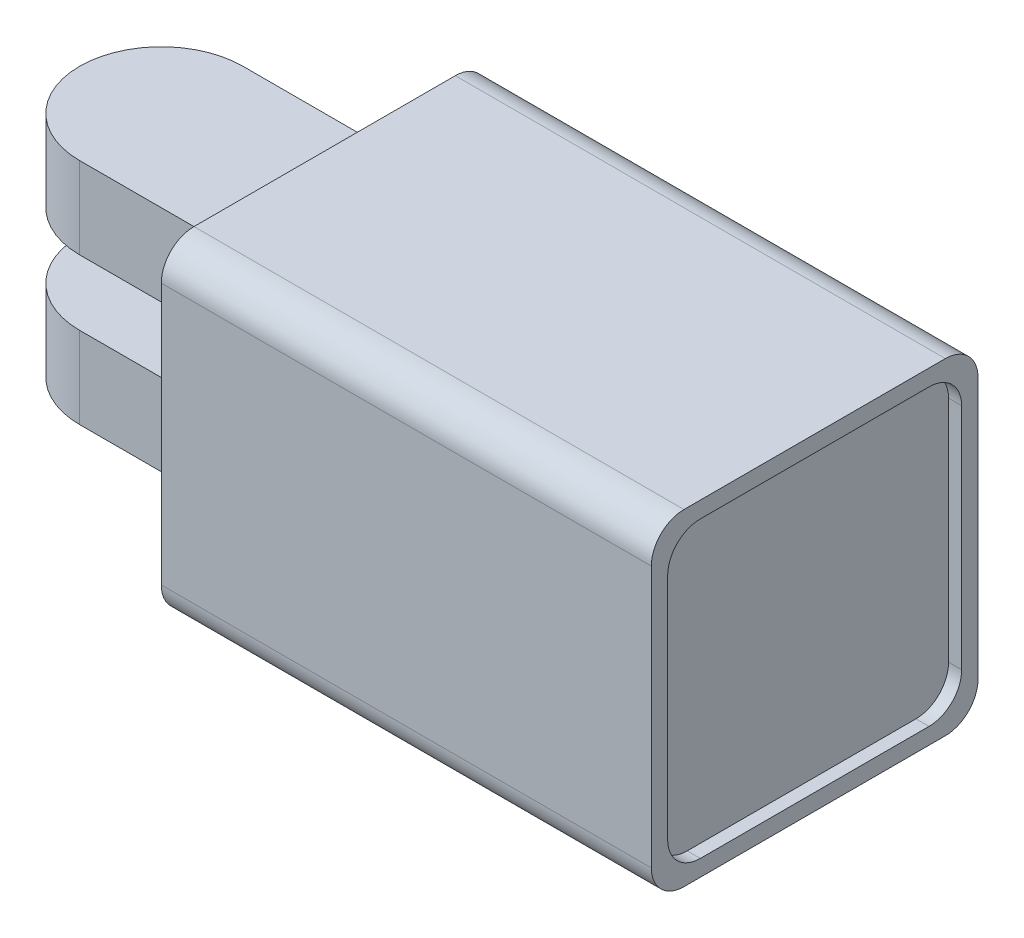
ISO-10303-21;
HEADER;
FILE_DESCRIPTION(('STEP AP214'),'2;1');
FILE_NAME('part.step','',(''),(''),'','','');
FILE_SCHEMA(('AUTOMOTIVE_DESIGN { 1 0 10303 214 1 1 1 1 }'));
ENDSEC;
DATA;
#1=APPLICATION_CONTEXT('core data for automotive mechanical design processes');
#2=APPLICATION_PROTOCOL_DEFINITION('international standard','automotive_design',2000,#1);
#3=PRODUCT_CONTEXT('',#1,'mechanical');
#4=PRODUCT('Part','Part','',(#3));
#5=PRODUCT_RELATED_PRODUCT_CATEGORY('part','',(#4));
#6=PRODUCT_DEFINITION_FORMATION('','',#4);
#7=PRODUCT_DEFINITION_CONTEXT('part definition',#1,'design');
#8=PRODUCT_DEFINITION('design','',#6,#7);
#9=PRODUCT_DEFINITION_SHAPE('','',#8);
#10=(LENGTH_UNIT() NAMED_UNIT(*) SI_UNIT(.MILLI.,.METRE.));
#11=(NAMED_UNIT(*) PLANE_ANGLE_UNIT() SI_UNIT($,.RADIAN.));
#12=(NAMED_UNIT(*) SI_UNIT($,.STERADIAN.) SOLID_ANGLE_UNIT());
#13=UNCERTAINTY_MEASURE_WITH_UNIT(LENGTH_MEASURE(1.E-05),#10,'distance_accuracy_value','');
#14=(GEOMETRIC_REPRESENTATION_CONTEXT(3) GLOBAL_UNCERTAINTY_ASSIGNED_CONTEXT((#13)) GLOBAL_UNIT_ASSIGNED_CONTEXT((#10,
#11,#12)) REPRESENTATION_CONTEXT('',''));
#15=CARTESIAN_POINT('',(0.,0.,0.));
#16=DIRECTION('',(0.,0.,1.));
#17=DIRECTION('',(1.,0.,0.));
#18=AXIS2_PLACEMENT_3D('',#15,#16,#17);
#19=CARTESIAN_POINT('',(0.,14.,0.));
#20=DIRECTION('',(0.,-1.,0.));
#21=DIRECTION('',(0.,0.,-1.));
#22=AXIS2_PLACEMENT_3D('',#19,#20,#21);
#23=CYLINDRICAL_SURFACE('',#22,5.);
#24=DIRECTION('',(0.,-1.,0.));
#25=VECTOR('',#24,1.);
#26=CARTESIAN_POINT('',(0.,14.,5.));
#27=LINE('',#26,#25);
#28=CARTESIAN_POINT('',(0.,5.,5.));
#29=VERTEX_POINT('',#28);
#30=CARTESIAN_POINT('',(0.,0.,5.));
#31=VERTEX_POINT('',#30);
#32=EDGE_CURVE('E473',#29,#31,#27,.T.);
#33=ORIENTED_EDGE('',*,*,#32,.F.);
#34=CARTESIAN_POINT('',(0.,5.,0.));
#35=DIRECTION('',(0.,-1.,0.));
#36=DIRECTION('',(0.,0.,-1.));
#37=AXIS2_PLACEMENT_3D('',#34,#35,#36);
#38=CIRCLE('',#37,5.);
#39=CARTESIAN_POINT('',(0.,5.,-5.));
#40=VERTEX_POINT('',#39);
#41=EDGE_CURVE('E296',#29,#40,#38,.T.);
#42=ORIENTED_EDGE('',*,*,#41,.T.);
#43=DIRECTION('',(0.,-1.,0.));
#44=VECTOR('',#43,1.);
#45=CARTESIAN_POINT('',(0.,14.,-5.));
#46=LINE('',#45,#44);
#47=CARTESIAN_POINT('',(0.,0.,-5.));
#48=VERTEX_POINT('',#47);
#49=EDGE_CURVE('E448',#40,#48,#46,.T.);
#50=ORIENTED_EDGE('',*,*,#49,.T.);
#51=CARTESIAN_POINT('',(0.,0.,0.));
#52=DIRECTION('',(0.,1.,0.));
#53=DIRECTION('',(0.,0.,1.));
#54=AXIS2_PLACEMENT_3D('',#51,#52,#53);
#55=CIRCLE('',#54,5.);
#56=EDGE_CURVE('E419',#48,#31,#55,.T.);
#57=ORIENTED_EDGE('',*,*,#56,.T.);
#58=EDGE_LOOP('',(#33,#42,#50,#57));
#59=FACE_BOUND('',#58,.T.);
#60=ADVANCED_FACE('F46',(#59),#23,.T.);
#61=CARTESIAN_POINT('',(37.,16.,-9.));
#62=DIRECTION('',(0.,0.,-1.));
#63=DIRECTION('',(0.,1.,0.));
#64=AXIS2_PLACEMENT_3D('',#61,#62,#63);
#65=PLANE('',#64);
#66=DIRECTION('',(0.,1.,0.));
#67=VECTOR('',#66,1.);
#68=CARTESIAN_POINT('',(39.2,14.,-9.));
#69=LINE('',#68,#67);
#70=CARTESIAN_POINT('',(39.2,0.,-9.));
#71=VERTEX_POINT('',#70);
#72=CARTESIAN_POINT('',(39.2,14.,-9.));
#73=VERTEX_POINT('',#72);
#74=EDGE_CURVE('E321',#71,#73,#69,.T.);
#75=ORIENTED_EDGE('',*,*,#74,.F.);
#76=DIRECTION('',(1.,0.,0.));
#77=VECTOR('',#76,1.);
#78=CARTESIAN_POINT('',(40.,0.,-9.));
#79=LINE('',#78,#77);
#80=CARTESIAN_POINT('',(40.,0.,-9.));
#81=VERTEX_POINT('',#80);
#82=EDGE_CURVE('E539',#71,#81,#79,.T.);
#83=ORIENTED_EDGE('',*,*,#82,.T.);
#84=DIRECTION('',(0.,1.,0.));
#85=VECTOR('',#84,1.);
#86=CARTESIAN_POINT('',(40.,16.,-9.));
#87=LINE('',#86,#85);
#88=CARTESIAN_POINT('',(40.,14.,-9.));
#89=VERTEX_POINT('',#88);
#90=EDGE_CURVE('E366',#81,#89,#87,.T.);
#91=ORIENTED_EDGE('',*,*,#90,.T.);
#92=DIRECTION('',(1.,0.,0.));
#93=VECTOR('',#92,1.);
#94=CARTESIAN_POINT('',(37.,14.,-9.));
#95=LINE('',#94,#93);
#96=EDGE_CURVE('E545',#89,#73,#95,.F.);
#97=ORIENTED_EDGE('',*,*,#96,.T.);
#98=EDGE_LOOP('',(#75,#83,#91,#97));
#99=FACE_BOUND('',#98,.T.);
#100=ADVANCED_FACE('F608',(#99),#65,.F.);
#101=CARTESIAN_POINT('',(37.,-2.00000000000001,9.));
#102=DIRECTION('',(0.,-1.,0.));
#103=DIRECTION('',(0.,0.,-1.));
#104=AXIS2_PLACEMENT_3D('',#101,#102,#103);
#105=PLANE('',#104);
#106=DIRECTION('',(0.,0.,-1.));
#107=VECTOR('',#106,1.);
#108=CARTESIAN_POINT('',(39.2,-2.00000000000001,7.));
#109=LINE('',#108,#107);
#110=CARTESIAN_POINT('',(39.2,-2.00000000000001,7.));
#111=VERTEX_POINT('',#110);
#112=CARTESIAN_POINT('',(39.2,-2.00000000000001,-7.));
#113=VERTEX_POINT('',#112);
#114=EDGE_CURVE('E313',#111,#113,#109,.T.);
#115=ORIENTED_EDGE('',*,*,#114,.F.);
#116=DIRECTION('',(1.,0.,0.));
#117=VECTOR('',#116,1.);
#118=CARTESIAN_POINT('',(40.,-2.00000000000001,7.));
#119=LINE('',#118,#117);
#120=CARTESIAN_POINT('',(40.,-2.00000000000001,7.));
#121=VERTEX_POINT('',#120);
#122=EDGE_CURVE('E561',#111,#121,#119,.T.);
#123=ORIENTED_EDGE('',*,*,#122,.T.);
#124=DIRECTION('',(0.,0.,-1.));
#125=VECTOR('',#124,1.);
#126=CARTESIAN_POINT('',(40.,-2.00000000000001,9.));
#127=LINE('',#126,#125);
#128=CARTESIAN_POINT('',(40.,-2.00000000000001,-7.));
#129=VERTEX_POINT('',#128);
#130=EDGE_CURVE('E375',#121,#129,#127,.T.);
#131=ORIENTED_EDGE('',*,*,#130,.T.);
#132=DIRECTION('',(1.,0.,0.));
#133=VECTOR('',#132,1.);
#134=CARTESIAN_POINT('',(37.,-2.00000000000001,-7.));
#135=LINE('',#134,#133);
#136=EDGE_CURVE('E567',#129,#113,#135,.F.);
#137=ORIENTED_EDGE('',*,*,#136,.T.);
#138=EDGE_LOOP('',(#115,#123,#131,#137));
#139=FACE_BOUND('',#138,.T.);
#140=ADVANCED_FACE('F616',(#139),#105,.F.);
#141=CARTESIAN_POINT('',(37.,16.,9.));
#142=DIRECTION('',(0.,0.,1.));
#143=DIRECTION('',(1.,0.,0.));
#144=AXIS2_PLACEMENT_3D('',#141,#142,#143);
#145=PLANE('',#144);
#146=DIRECTION('',(0.,-1.,0.));
#147=VECTOR('',#146,1.);
#148=CARTESIAN_POINT('',(39.2,14.,9.));
#149=LINE('',#148,#147);
#150=CARTESIAN_POINT('',(39.2,14.,9.));
#151=VERTEX_POINT('',#150);
#152=CARTESIAN_POINT('',(39.2,0.,9.));
#153=VERTEX_POINT('',#152);
#154=EDGE_CURVE('E304',#151,#153,#149,.T.);
#155=ORIENTED_EDGE('',*,*,#154,.F.);
#156=DIRECTION('',(1.,0.,0.));
#157=VECTOR('',#156,1.);
#158=CARTESIAN_POINT('',(40.,14.,9.));
#159=LINE('',#158,#157);
#160=CARTESIAN_POINT('',(40.,14.,9.));
#161=VERTEX_POINT('',#160);
#162=EDGE_CURVE('E571',#151,#161,#159,.T.);
#163=ORIENTED_EDGE('',*,*,#162,.T.);
#164=DIRECTION('',(0.,-1.,0.));
#165=VECTOR('',#164,1.);
#166=CARTESIAN_POINT('',(40.,16.,9.));
#167=LINE('',#166,#165);
#168=CARTESIAN_POINT('',(40.,0.,9.));
#169=VERTEX_POINT('',#168);
#170=EDGE_CURVE('E395',#161,#169,#167,.T.);
#171=ORIENTED_EDGE('',*,*,#170,.T.);
#172=DIRECTION('',(1.,0.,0.));
#173=VECTOR('',#172,1.);
#174=CARTESIAN_POINT('',(37.,0.,9.));
#175=LINE('',#174,#173);
#176=EDGE_CURVE('E577',#169,#153,#175,.F.);
#177=ORIENTED_EDGE('',*,*,#176,.T.);
#178=EDGE_LOOP('',(#155,#163,#171,#177));
#179=FACE_BOUND('',#178,.T.);
#180=ADVANCED_FACE('F722',(#179),#145,.F.);
#181=CARTESIAN_POINT('',(37.,16.,9.));
#182=DIRECTION('',(0.,1.,0.));
#183=DIRECTION('',(0.,0.,1.));
#184=AXIS2_PLACEMENT_3D('',#181,#182,#183);
#185=PLANE('',#184);
#186=DIRECTION('',(0.,0.,1.));
#187=VECTOR('',#186,1.);
#188=CARTESIAN_POINT('',(39.2,16.,7.));
#189=LINE('',#188,#187);
#190=CARTESIAN_POINT('',(39.2,16.,-7.));
#191=VERTEX_POINT('',#190);
#192=CARTESIAN_POINT('',(39.2,16.,7.));
#193=VERTEX_POINT('',#192);
#194=EDGE_CURVE('E70',#191,#193,#189,.T.);
#195=ORIENTED_EDGE('',*,*,#194,.F.);
#196=DIRECTION('',(1.,0.,0.));
#197=VECTOR('',#196,1.);
#198=CARTESIAN_POINT('',(40.,16.,-7.));
#199=LINE('',#198,#197);
#200=CARTESIAN_POINT('',(40.,16.,-7.));
#201=VERTEX_POINT('',#200);
#202=EDGE_CURVE('E534',#191,#201,#199,.T.);
#203=ORIENTED_EDGE('',*,*,#202,.T.);
#204=DIRECTION('',(0.,0.,1.));
#205=VECTOR('',#204,1.);
#206=CARTESIAN_POINT('',(40.,16.,9.));
#207=LINE('',#206,#205);
#208=CARTESIAN_POINT('',(40.,16.,7.));
#209=VERTEX_POINT('',#208);
#210=EDGE_CURVE('E391',#201,#209,#207,.T.);
#211=ORIENTED_EDGE('',*,*,#210,.T.);
#212=DIRECTION('',(1.,0.,0.));
#213=VECTOR('',#212,1.);
#214=CARTESIAN_POINT('',(37.,16.,7.));
#215=LINE('',#214,#213);
#216=EDGE_CURVE('E531',#209,#193,#215,.F.);
#217=ORIENTED_EDGE('',*,*,#216,.T.);
#218=EDGE_LOOP('',(#195,#203,#211,#217));
#219=FACE_BOUND('',#218,.T.);
#220=ADVANCED_FACE('F598',(#219),#185,.F.);
#221=CARTESIAN_POINT('',(37.,14.,-7.));
#222=DIRECTION('',(-1.,0.,0.));
#223=DIRECTION('',(0.,0.,1.));
#224=AXIS2_PLACEMENT_3D('',#221,#222,#223);
#225=CYLINDRICAL_SURFACE('',#224,2.);
#226=CARTESIAN_POINT('',(39.2,14.,-7.));
#227=DIRECTION('',(1.,0.,0.));
#228=DIRECTION('',(0.,0.,1.));
#229=AXIS2_PLACEMENT_3D('',#226,#227,#228);
#230=CIRCLE('',#229,2.);
#231=EDGE_CURVE('E325',#73,#191,#230,.T.);
#232=ORIENTED_EDGE('',*,*,#231,.F.);
#233=ORIENTED_EDGE('',*,*,#96,.F.);
#234=CARTESIAN_POINT('',(40.,14.,-7.));
#235=DIRECTION('',(-1.,0.,0.));
#236=DIRECTION('',(0.,0.,1.));
#237=AXIS2_PLACEMENT_3D('',#234,#235,#236);
#238=CIRCLE('',#237,2.);
#239=EDGE_CURVE('E581',#201,#89,#238,.T.);
#240=ORIENTED_EDGE('',*,*,#239,.F.);
#241=ORIENTED_EDGE('',*,*,#202,.F.);
#242=EDGE_LOOP('',(#232,#233,#240,#241));
#243=FACE_BOUND('',#242,.T.);
#244=ADVANCED_FACE('F606',(#243),#225,.F.);
#245=CARTESIAN_POINT('',(37.,0.,-7.));
#246=DIRECTION('',(-1.,0.,0.));
#247=DIRECTION('',(0.,0.,1.));
#248=AXIS2_PLACEMENT_3D('',#245,#246,#247);
#249=CYLINDRICAL_SURFACE('',#248,2.);
#250=CARTESIAN_POINT('',(39.2,0.,-7.));
#251=DIRECTION('',(1.,0.,0.));
#252=DIRECTION('',(0.,0.,1.));
#253=AXIS2_PLACEMENT_3D('',#250,#251,#252);
#254=CIRCLE('',#253,2.);
#255=EDGE_CURVE('E317',#113,#71,#254,.T.);
#256=ORIENTED_EDGE('',*,*,#255,.F.);
#257=ORIENTED_EDGE('',*,*,#136,.F.);
#258=CARTESIAN_POINT('',(40.,0.,-7.));
#259=DIRECTION('',(-1.,0.,0.));
#260=DIRECTION('',(0.,0.,1.));
#261=AXIS2_PLACEMENT_3D('',#258,#259,#260);
#262=CIRCLE('',#261,2.);
#263=EDGE_CURVE('E584',#81,#129,#262,.T.);
#264=ORIENTED_EDGE('',*,*,#263,.F.);
#265=ORIENTED_EDGE('',*,*,#82,.F.);
#266=EDGE_LOOP('',(#256,#257,#264,#265));
#267=FACE_BOUND('',#266,.T.);
#268=ADVANCED_FACE('F619',(#267),#249,.F.);
#269=CARTESIAN_POINT('',(37.,0.,7.));
#270=DIRECTION('',(-1.,0.,0.));
#271=DIRECTION('',(0.,0.,1.));
#272=AXIS2_PLACEMENT_3D('',#269,#270,#271);
#273=CYLINDRICAL_SURFACE('',#272,2.);
#274=CARTESIAN_POINT('',(39.2,0.,7.));
#275=DIRECTION('',(1.,0.,0.));
#276=DIRECTION('',(0.,0.,1.));
#277=AXIS2_PLACEMENT_3D('',#274,#275,#276);
#278=CIRCLE('',#277,2.);
#279=EDGE_CURVE('E309',#153,#111,#278,.T.);
#280=ORIENTED_EDGE('',*,*,#279,.F.);
#281=ORIENTED_EDGE('',*,*,#176,.F.);
#282=CARTESIAN_POINT('',(40.,0.,7.));
#283=DIRECTION('',(-1.,0.,0.));
#284=DIRECTION('',(0.,0.,1.));
#285=AXIS2_PLACEMENT_3D('',#282,#283,#284);
#286=CIRCLE('',#285,2.);
#287=EDGE_CURVE('E587',#121,#169,#286,.T.);
#288=ORIENTED_EDGE('',*,*,#287,.F.);
#289=ORIENTED_EDGE('',*,*,#122,.F.);
#290=EDGE_LOOP('',(#280,#281,#288,#289));
#291=FACE_BOUND('',#290,.T.);
#292=ADVANCED_FACE('F621',(#291),#273,.F.);
#293=CARTESIAN_POINT('',(37.,14.,7.));
#294=DIRECTION('',(-1.,0.,0.));
#295=DIRECTION('',(0.,0.,1.));
#296=AXIS2_PLACEMENT_3D('',#293,#294,#295);
#297=CYLINDRICAL_SURFACE('',#296,2.);
#298=CARTESIAN_POINT('',(39.2,14.,7.));
#299=DIRECTION('',(1.,0.,0.));
#300=DIRECTION('',(0.,0.,1.));
#301=AXIS2_PLACEMENT_3D('',#298,#299,#300);
#302=CIRCLE('',#301,2.);
#303=EDGE_CURVE('E300',#193,#151,#302,.T.);
#304=ORIENTED_EDGE('',*,*,#303,.F.);
#305=ORIENTED_EDGE('',*,*,#216,.F.);
#306=CARTESIAN_POINT('',(40.,14.,7.));
#307=DIRECTION('',(-1.,0.,0.));
#308=DIRECTION('',(0.,0.,1.));
#309=AXIS2_PLACEMENT_3D('',#306,#307,#308);
#310=CIRCLE('',#309,2.);
#311=EDGE_CURVE('E56',#161,#209,#310,.T.);
#312=ORIENTED_EDGE('',*,*,#311,.F.);
#313=ORIENTED_EDGE('',*,*,#162,.F.);
#314=EDGE_LOOP('',(#304,#305,#312,#313));
#315=FACE_BOUND('',#314,.T.);
#316=ADVANCED_FACE('F600',(#315),#297,.F.);
#317=CARTESIAN_POINT('',(0.,14.,-5.));
#318=VERTEX_POINT('',#317);
#319=CARTESIAN_POINT('',(0.,9.,-5.));
#320=VERTEX_POINT('',#319);
#321=EDGE_CURVE('E463',#318,#320,#46,.T.);
#322=ORIENTED_EDGE('',*,*,#321,.T.);
#323=CARTESIAN_POINT('',(0.,9.,0.));
#324=DIRECTION('',(0.,1.,0.));
#325=DIRECTION('',(0.,0.,1.));
#326=AXIS2_PLACEMENT_3D('',#323,#324,#325);
#327=CIRCLE('',#326,5.);
#328=CARTESIAN_POINT('',(0.,9.,5.));
#329=VERTEX_POINT('',#328);
#330=EDGE_CURVE('E63',#320,#329,#327,.T.);
#331=ORIENTED_EDGE('',*,*,#330,.T.);
#332=CARTESIAN_POINT('',(0.,14.,5.));
#333=VERTEX_POINT('',#332);
#334=EDGE_CURVE('E474',#333,#329,#27,.T.);
#335=ORIENTED_EDGE('',*,*,#334,.F.);
#336=CARTESIAN_POINT('',(0.,14.,0.));
#337=DIRECTION('',(0.,1.,0.));
#338=DIRECTION('',(0.,0.,1.));
#339=AXIS2_PLACEMENT_3D('',#336,#337,#338);
#340=CIRCLE('',#339,5.);
#341=EDGE_CURVE('E434',#318,#333,#340,.T.);
#342=ORIENTED_EDGE('',*,*,#341,.F.);
#343=EDGE_LOOP('',(#322,#331,#335,#342));
#344=FACE_BOUND('',#343,.T.);
#345=ADVANCED_FACE('F652',(#344),#23,.T.);
#346=CARTESIAN_POINT('',(10.,14.,5.));
#347=DIRECTION('',(0.,0.,-1.));
#348=DIRECTION('',(-1.,0.,0.));
#349=AXIS2_PLACEMENT_3D('',#346,#347,#348);
#350=PLANE('',#349);
#351=DIRECTION('',(0.,-1.,0.));
#352=VECTOR('',#351,1.);
#353=CARTESIAN_POINT('',(5.,14.,5.));
#354=LINE('',#353,#352);
#355=CARTESIAN_POINT('',(5.,9.,5.));
#356=VERTEX_POINT('',#355);
#357=CARTESIAN_POINT('',(5.,5.,5.));
#358=VERTEX_POINT('',#357);
#359=EDGE_CURVE('E265',#356,#358,#354,.T.);
#360=ORIENTED_EDGE('',*,*,#359,.T.);
#361=DIRECTION('',(-1.,0.,0.));
#362=VECTOR('',#361,1.);
#363=CARTESIAN_POINT('',(10.,5.,5.));
#364=LINE('',#363,#362);
#365=EDGE_CURVE('E292',#358,#29,#364,.T.);
#366=ORIENTED_EDGE('',*,*,#365,.T.);
#367=ORIENTED_EDGE('',*,*,#32,.T.);
#368=DIRECTION('',(1.,0.,0.));
#369=VECTOR('',#368,1.);
#370=CARTESIAN_POINT('',(10.,0.,5.));
#371=LINE('',#370,#369);
#372=CARTESIAN_POINT('',(10.,0.,5.));
#373=VERTEX_POINT('',#372);
#374=EDGE_CURVE('E452',#31,#373,#371,.T.);
#375=ORIENTED_EDGE('',*,*,#374,.T.);
#376=DIRECTION('',(0.,-1.,0.));
#377=VECTOR('',#376,1.);
#378=CARTESIAN_POINT('',(10.,14.,5.));
#379=LINE('',#378,#377);
#380=CARTESIAN_POINT('',(10.,14.,5.));
#381=VERTEX_POINT('',#380);
#382=EDGE_CURVE('E469',#381,#373,#379,.T.);
#383=ORIENTED_EDGE('',*,*,#382,.F.);
#384=DIRECTION('',(1.,0.,0.));
#385=VECTOR('',#384,1.);
#386=CARTESIAN_POINT('',(10.,14.,5.));
#387=LINE('',#386,#385);
#388=EDGE_CURVE('E438',#333,#381,#387,.T.);
#389=ORIENTED_EDGE('',*,*,#388,.F.);
#390=ORIENTED_EDGE('',*,*,#334,.T.);
#391=DIRECTION('',(1.,0.,0.));
#392=VECTOR('',#391,1.);
#393=CARTESIAN_POINT('',(10.,9.,5.));
#394=LINE('',#393,#392);
#395=EDGE_CURVE('E284',#329,#356,#394,.T.);
#396=ORIENTED_EDGE('',*,*,#395,.T.);
#397=EDGE_LOOP('',(#360,#366,#367,#375,#383,#389,#390,#396));
#398=FACE_BOUND('',#397,.T.);
#399=ADVANCED_FACE('F642',(#398),#350,.F.);
#400=CARTESIAN_POINT('',(0.,14.,-5.));
#401=DIRECTION('',(0.,0.,1.));
#402=DIRECTION('',(1.,0.,0.));
#403=AXIS2_PLACEMENT_3D('',#400,#401,#402);
#404=PLANE('',#403);
#405=ORIENTED_EDGE('',*,*,#49,.F.);
#406=DIRECTION('',(-1.,0.,0.));
#407=VECTOR('',#406,1.);
#408=CARTESIAN_POINT('',(5.,5.,-5.));
#409=LINE('',#408,#407);
#410=CARTESIAN_POINT('',(5.,5.,-5.));
#411=VERTEX_POINT('',#410);
#412=EDGE_CURVE('E269',#411,#40,#409,.T.);
#413=ORIENTED_EDGE('',*,*,#412,.F.);
#414=DIRECTION('',(0.,-1.,0.));
#415=VECTOR('',#414,1.);
#416=CARTESIAN_POINT('',(5.,9.,-5.));
#417=LINE('',#416,#415);
#418=CARTESIAN_POINT('',(5.,9.,-5.));
#419=VERTEX_POINT('',#418);
#420=EDGE_CURVE('E262',#419,#411,#417,.T.);
#421=ORIENTED_EDGE('',*,*,#420,.F.);
#422=DIRECTION('',(-1.,0.,0.));
#423=VECTOR('',#422,1.);
#424=CARTESIAN_POINT('',(0.,9.,-5.));
#425=LINE('',#424,#423);
#426=EDGE_CURVE('E11',#419,#320,#425,.T.);
#427=ORIENTED_EDGE('',*,*,#426,.T.);
#428=ORIENTED_EDGE('',*,*,#321,.F.);
#429=DIRECTION('',(-1.,0.,0.));
#430=VECTOR('',#429,1.);
#431=CARTESIAN_POINT('',(0.,14.,-5.));
#432=LINE('',#431,#430);
#433=CARTESIAN_POINT('',(10.,14.,-5.));
#434=VERTEX_POINT('',#433);
#435=EDGE_CURVE('E445',#434,#318,#432,.T.);
#436=ORIENTED_EDGE('',*,*,#435,.F.);
#437=DIRECTION('',(0.,-1.,0.));
#438=VECTOR('',#437,1.);
#439=CARTESIAN_POINT('',(10.,14.,-5.));
#440=LINE('',#439,#438);
#441=CARTESIAN_POINT('',(10.,0.,-5.));
#442=VERTEX_POINT('',#441);
#443=EDGE_CURVE('E466',#434,#442,#440,.T.);
#444=ORIENTED_EDGE('',*,*,#443,.T.);
#445=DIRECTION('',(-1.,0.,0.));
#446=VECTOR('',#445,1.);
#447=CARTESIAN_POINT('',(0.,0.,-5.));
#448=LINE('',#447,#446);
#449=EDGE_CURVE('E439',#442,#48,#448,.T.);
#450=ORIENTED_EDGE('',*,*,#449,.T.);
#451=EDGE_LOOP('',(#405,#413,#421,#427,#428,#436,#444,#450));
#452=FACE_BOUND('',#451,.T.);
#453=ADVANCED_FACE('F276',(#452),#404,.F.);
#454=CARTESIAN_POINT('',(0.,14.,0.));
#455=DIRECTION('',(0.,1.,0.));
#456=DIRECTION('',(0.,0.,1.));
#457=AXIS2_PLACEMENT_3D('',#454,#455,#456);
#458=PLANE('',#457);
#459=ORIENTED_EDGE('',*,*,#341,.T.);
#460=ORIENTED_EDGE('',*,*,#388,.T.);
#461=DIRECTION('',(0.,0.,-1.));
#462=VECTOR('',#461,1.);
#463=CARTESIAN_POINT('',(10.,14.,-5.));
#464=LINE('',#463,#462);
#465=EDGE_CURVE('E442',#381,#434,#464,.T.);
#466=ORIENTED_EDGE('',*,*,#465,.T.);
#467=ORIENTED_EDGE('',*,*,#435,.T.);
#468=EDGE_LOOP('',(#459,#460,#466,#467));
#469=FACE_BOUND('',#468,.T.);
#470=ADVANCED_FACE('F648',(#469),#458,.T.);
#471=CARTESIAN_POINT('',(0.,0.,0.));
#472=DIRECTION('',(0.,1.,0.));
#473=DIRECTION('',(0.,0.,1.));
#474=AXIS2_PLACEMENT_3D('',#471,#472,#473);
#475=PLANE('',#474);
#476=ORIENTED_EDGE('',*,*,#56,.F.);
#477=ORIENTED_EDGE('',*,*,#449,.F.);
#478=DIRECTION('',(0.,0.,-1.));
#479=VECTOR('',#478,1.);
#480=CARTESIAN_POINT('',(10.,0.,-5.));
#481=LINE('',#480,#479);
#482=EDGE_CURVE('E456',#373,#442,#481,.T.);
#483=ORIENTED_EDGE('',*,*,#482,.F.);
#484=ORIENTED_EDGE('',*,*,#374,.F.);
#485=EDGE_LOOP('',(#476,#477,#483,#484));
#486=FACE_BOUND('',#485,.T.);
#487=ADVANCED_FACE('F639',(#486),#475,.F.);
#488=CARTESIAN_POINT('',(40.,-3.,-10.));
#489=DIRECTION('',(0.,0.,1.));
#490=DIRECTION('',(1.,0.,0.));
#491=AXIS2_PLACEMENT_3D('',#488,#489,#490);
#492=PLANE('',#491);
#493=DIRECTION('',(0.,1.,0.));
#494=VECTOR('',#493,1.);
#495=CARTESIAN_POINT('',(10.,-3.,-10.));
#496=LINE('',#495,#494);
#497=CARTESIAN_POINT('',(10.,-1.,-10.));
#498=VERTEX_POINT('',#497);
#499=CARTESIAN_POINT('',(10.,15.,-10.));
#500=VERTEX_POINT('',#499);
#501=EDGE_CURVE('E387',#498,#500,#496,.T.);
#502=ORIENTED_EDGE('',*,*,#501,.T.);
#503=DIRECTION('',(-1.,0.,0.));
#504=VECTOR('',#503,1.);
#505=CARTESIAN_POINT('',(40.,15.,-10.));
#506=LINE('',#505,#504);
#507=CARTESIAN_POINT('',(40.,15.,-10.));
#508=VERTEX_POINT('',#507);
#509=EDGE_CURVE('E501',#500,#508,#506,.F.);
#510=ORIENTED_EDGE('',*,*,#509,.T.);
#511=DIRECTION('',(0.,1.,0.));
#512=VECTOR('',#511,1.);
#513=CARTESIAN_POINT('',(40.,-3.,-10.));
#514=LINE('',#513,#512);
#515=CARTESIAN_POINT('',(40.,-1.,-10.));
#516=VERTEX_POINT('',#515);
#517=EDGE_CURVE('E402',#516,#508,#514,.T.);
#518=ORIENTED_EDGE('',*,*,#517,.F.);
#519=DIRECTION('',(-1.,0.,0.));
#520=VECTOR('',#519,1.);
#521=CARTESIAN_POINT('',(40.,-1.,-10.));
#522=LINE('',#521,#520);
#523=EDGE_CURVE('E497',#516,#498,#522,.T.);
#524=ORIENTED_EDGE('',*,*,#523,.T.);
#525=EDGE_LOOP('',(#502,#510,#518,#524));
#526=FACE_BOUND('',#525,.T.);
#527=ADVANCED_FACE('F744',(#526),#492,.F.);
#528=CARTESIAN_POINT('',(40.,17.,10.));
#529=DIRECTION('',(0.,-1.,0.));
#530=DIRECTION('',(0.,0.,-1.));
#531=AXIS2_PLACEMENT_3D('',#528,#529,#530);
#532=PLANE('',#531);
#533=DIRECTION('',(0.,0.,1.));
#534=VECTOR('',#533,1.);
#535=CARTESIAN_POINT('',(40.,17.,10.));
#536=LINE('',#535,#534);
#537=CARTESIAN_POINT('',(40.,17.,-8.00000000000001));
#538=VERTEX_POINT('',#537);
#539=CARTESIAN_POINT('',(40.,17.,8.));
#540=VERTEX_POINT('',#539);
#541=EDGE_CURVE('E406',#538,#540,#536,.T.);
#542=ORIENTED_EDGE('',*,*,#541,.F.);
#543=DIRECTION('',(-1.,0.,0.));
#544=VECTOR('',#543,1.);
#545=CARTESIAN_POINT('',(40.,17.,-8.00000000000001));
#546=LINE('',#545,#544);
#547=CARTESIAN_POINT('',(10.,17.,-8.00000000000001));
#548=VERTEX_POINT('',#547);
#549=EDGE_CURVE('E481',#538,#548,#546,.T.);
#550=ORIENTED_EDGE('',*,*,#549,.T.);
#551=DIRECTION('',(0.,0.,1.));
#552=VECTOR('',#551,1.);
#553=CARTESIAN_POINT('',(10.,17.,10.));
#554=LINE('',#553,#552);
#555=CARTESIAN_POINT('',(10.,17.,8.));
#556=VERTEX_POINT('',#555);
#557=EDGE_CURVE('E423',#548,#556,#554,.T.);
#558=ORIENTED_EDGE('',*,*,#557,.T.);
#559=DIRECTION('',(-1.,0.,0.));
#560=VECTOR('',#559,1.);
#561=CARTESIAN_POINT('',(40.,17.,8.));
#562=LINE('',#561,#560);
#563=EDGE_CURVE('E478',#556,#540,#562,.F.);
#564=ORIENTED_EDGE('',*,*,#563,.T.);
#565=EDGE_LOOP('',(#542,#550,#558,#564));
#566=FACE_BOUND('',#565,.T.);
#567=ADVANCED_FACE('F740',(#566),#532,.F.);
#568=CARTESIAN_POINT('',(40.,-3.,10.));
#569=DIRECTION('',(0.,0.,-1.));
#570=DIRECTION('',(-1.,0.,0.));
#571=AXIS2_PLACEMENT_3D('',#568,#569,#570);
#572=PLANE('',#571);
#573=DIRECTION('',(0.,-1.,0.));
#574=VECTOR('',#573,1.);
#575=CARTESIAN_POINT('',(10.,-3.,10.));
#576=LINE('',#575,#574);
#577=CARTESIAN_POINT('',(10.,15.,10.));
#578=VERTEX_POINT('',#577);
#579=CARTESIAN_POINT('',(10.,-1.,10.));
#580=VERTEX_POINT('',#579);
#581=EDGE_CURVE('E427',#578,#580,#576,.T.);
#582=ORIENTED_EDGE('',*,*,#581,.T.);
#583=DIRECTION('',(-1.,0.,0.));
#584=VECTOR('',#583,1.);
#585=CARTESIAN_POINT('',(40.,-1.,10.));
#586=LINE('',#585,#584);
#587=CARTESIAN_POINT('',(40.,-1.,10.));
#588=VERTEX_POINT('',#587);
#589=EDGE_CURVE('E527',#580,#588,#586,.F.);
#590=ORIENTED_EDGE('',*,*,#589,.T.);
#591=DIRECTION('',(0.,-1.,0.));
#592=VECTOR('',#591,1.);
#593=CARTESIAN_POINT('',(40.,-3.,10.));
#594=LINE('',#593,#592);
#595=CARTESIAN_POINT('',(40.,15.,10.));
#596=VERTEX_POINT('',#595);
#597=EDGE_CURVE('E411',#596,#588,#594,.T.);
#598=ORIENTED_EDGE('',*,*,#597,.F.);
#599=DIRECTION('',(-1.,0.,0.));
#600=VECTOR('',#599,1.);
#601=CARTESIAN_POINT('',(40.,15.,10.));
#602=LINE('',#601,#600);
#603=EDGE_CURVE('E523',#596,#578,#602,.T.);
#604=ORIENTED_EDGE('',*,*,#603,.T.);
#605=EDGE_LOOP('',(#582,#590,#598,#604));
#606=FACE_BOUND('',#605,.T.);
#607=ADVANCED_FACE('F736',(#606),#572,.F.);
#608=CARTESIAN_POINT('',(40.,-3.,10.));
#609=DIRECTION('',(0.,1.,0.));
#610=DIRECTION('',(0.,0.,1.));
#611=AXIS2_PLACEMENT_3D('',#608,#609,#610);
#612=PLANE('',#611);
#613=DIRECTION('',(0.,0.,-1.));
#614=VECTOR('',#613,1.);
#615=CARTESIAN_POINT('',(10.,-3.,10.));
#616=LINE('',#615,#614);
#617=CARTESIAN_POINT('',(10.,-3.,8.));
#618=VERTEX_POINT('',#617);
#619=CARTESIAN_POINT('',(10.,-3.,-8.00000000000001));
#620=VERTEX_POINT('',#619);
#621=EDGE_CURVE('E407',#618,#620,#616,.T.);
#622=ORIENTED_EDGE('',*,*,#621,.T.);
#623=DIRECTION('',(-1.,0.,0.));
#624=VECTOR('',#623,1.);
#625=CARTESIAN_POINT('',(40.,-3.,-8.00000000000001));
#626=LINE('',#625,#624);
#627=CARTESIAN_POINT('',(40.,-3.,-8.00000000000001));
#628=VERTEX_POINT('',#627);
#629=EDGE_CURVE('E520',#620,#628,#626,.F.);
#630=ORIENTED_EDGE('',*,*,#629,.T.);
#631=DIRECTION('',(0.,0.,-1.));
#632=VECTOR('',#631,1.);
#633=CARTESIAN_POINT('',(40.,-3.,10.));
#634=LINE('',#633,#632);
#635=CARTESIAN_POINT('',(40.,-3.,8.));
#636=VERTEX_POINT('',#635);
#637=EDGE_CURVE('E415',#636,#628,#634,.T.);
#638=ORIENTED_EDGE('',*,*,#637,.F.);
#639=DIRECTION('',(-1.,0.,0.));
#640=VECTOR('',#639,1.);
#641=CARTESIAN_POINT('',(40.,-3.,8.));
#642=LINE('',#641,#640);
#643=EDGE_CURVE('E516',#636,#618,#642,.T.);
#644=ORIENTED_EDGE('',*,*,#643,.T.);
#645=EDGE_LOOP('',(#622,#630,#638,#644));
#646=FACE_BOUND('',#645,.T.);
#647=ADVANCED_FACE('F730',(#646),#612,.F.);
#648=CARTESIAN_POINT('',(40.,0.,0.));
#649=DIRECTION('',(-1.,0.,0.));
#650=DIRECTION('',(0.,0.,1.));
#651=AXIS2_PLACEMENT_3D('',#648,#649,#650);
#652=PLANE('',#651);
#653=ORIENTED_EDGE('',*,*,#210,.F.);
#654=ORIENTED_EDGE('',*,*,#239,.T.);
#655=ORIENTED_EDGE('',*,*,#90,.F.);
#656=ORIENTED_EDGE('',*,*,#263,.T.);
#657=ORIENTED_EDGE('',*,*,#130,.F.);
#658=ORIENTED_EDGE('',*,*,#287,.T.);
#659=ORIENTED_EDGE('',*,*,#170,.F.);
#660=ORIENTED_EDGE('',*,*,#311,.T.);
#661=EDGE_LOOP('',(#653,#654,#655,#656,#657,#658,#659,#660));
#662=FACE_BOUND('',#661,.T.);
#663=ORIENTED_EDGE('',*,*,#517,.T.);
#664=CARTESIAN_POINT('',(40.,15.,-8.00000000000001));
#665=DIRECTION('',(-1.,0.,0.));
#666=DIRECTION('',(0.,0.,1.));
#667=AXIS2_PLACEMENT_3D('',#664,#665,#666);
#668=CIRCLE('',#667,2.);
#669=EDGE_CURVE('E513',#508,#538,#668,.F.);
#670=ORIENTED_EDGE('',*,*,#669,.T.);
#671=ORIENTED_EDGE('',*,*,#541,.T.);
#672=CARTESIAN_POINT('',(40.,15.,8.));
#673=DIRECTION('',(-1.,0.,0.));
#674=DIRECTION('',(0.,0.,1.));
#675=AXIS2_PLACEMENT_3D('',#672,#673,#674);
#676=CIRCLE('',#675,2.);
#677=EDGE_CURVE('E504',#540,#596,#676,.F.);
#678=ORIENTED_EDGE('',*,*,#677,.T.);
#679=ORIENTED_EDGE('',*,*,#597,.T.);
#680=CARTESIAN_POINT('',(40.,-1.,8.));
#681=DIRECTION('',(-1.,0.,0.));
#682=DIRECTION('',(0.,0.,1.));
#683=AXIS2_PLACEMENT_3D('',#680,#681,#682);
#684=CIRCLE('',#683,2.);
#685=EDGE_CURVE('E507',#588,#636,#684,.F.);
#686=ORIENTED_EDGE('',*,*,#685,.T.);
#687=ORIENTED_EDGE('',*,*,#637,.T.);
#688=CARTESIAN_POINT('',(40.,-1.,-8.));
#689=DIRECTION('',(-1.,0.,0.));
#690=DIRECTION('',(0.,0.,1.));
#691=AXIS2_PLACEMENT_3D('',#688,#689,#690);
#692=CIRCLE('',#691,2.);
#693=EDGE_CURVE('E510',#628,#516,#692,.F.);
#694=ORIENTED_EDGE('',*,*,#693,.T.);
#695=EDGE_LOOP('',(#663,#670,#671,#678,#679,#686,#687,#694));
#696=FACE_BOUND('',#695,.T.);
#697=ADVANCED_FACE('F594',(#662,#696),#652,.F.);
#698=CARTESIAN_POINT('',(10.,0.,0.));
#699=DIRECTION('',(-1.,0.,0.));
#700=DIRECTION('',(0.,0.,1.));
#701=AXIS2_PLACEMENT_3D('',#698,#699,#700);
#702=PLANE('',#701);
#703=ORIENTED_EDGE('',*,*,#382,.T.);
#704=ORIENTED_EDGE('',*,*,#482,.T.);
#705=ORIENTED_EDGE('',*,*,#443,.F.);
#706=ORIENTED_EDGE('',*,*,#465,.F.);
#707=EDGE_LOOP('',(#703,#704,#705,#706));
#708=FACE_BOUND('',#707,.T.);
#709=ORIENTED_EDGE('',*,*,#557,.F.);
#710=CARTESIAN_POINT('',(10.,15.,-8.00000000000001));
#711=DIRECTION('',(-1.,0.,0.));
#712=DIRECTION('',(0.,0.,1.));
#713=AXIS2_PLACEMENT_3D('',#710,#711,#712);
#714=CIRCLE('',#713,2.);
#715=EDGE_CURVE('E494',#548,#500,#714,.T.);
#716=ORIENTED_EDGE('',*,*,#715,.T.);
#717=ORIENTED_EDGE('',*,*,#501,.F.);
#718=CARTESIAN_POINT('',(10.,-1.,-8.));
#719=DIRECTION('',(-1.,0.,0.));
#720=DIRECTION('',(0.,0.,1.));
#721=AXIS2_PLACEMENT_3D('',#718,#719,#720);
#722=CIRCLE('',#721,2.);
#723=EDGE_CURVE('E491',#498,#620,#722,.T.);
#724=ORIENTED_EDGE('',*,*,#723,.T.);
#725=ORIENTED_EDGE('',*,*,#621,.F.);
#726=CARTESIAN_POINT('',(10.,-1.,8.));
#727=DIRECTION('',(-1.,0.,0.));
#728=DIRECTION('',(0.,0.,1.));
#729=AXIS2_PLACEMENT_3D('',#726,#727,#728);
#730=CIRCLE('',#729,2.);
#731=EDGE_CURVE('E488',#618,#580,#730,.T.);
#732=ORIENTED_EDGE('',*,*,#731,.T.);
#733=ORIENTED_EDGE('',*,*,#581,.F.);
#734=CARTESIAN_POINT('',(10.,15.,8.));
#735=DIRECTION('',(-1.,0.,0.));
#736=DIRECTION('',(0.,0.,1.));
#737=AXIS2_PLACEMENT_3D('',#734,#735,#736);
#738=CIRCLE('',#737,2.);
#739=EDGE_CURVE('E485',#578,#556,#738,.T.);
#740=ORIENTED_EDGE('',*,*,#739,.T.);
#741=EDGE_LOOP('',(#709,#716,#717,#724,#725,#732,#733,#740));
#742=FACE_BOUND('',#741,.T.);
#743=ADVANCED_FACE('F645',(#708,#742),#702,.T.);
#744=CARTESIAN_POINT('',(40.,15.,-8.00000000000001));
#745=DIRECTION('',(-1.,0.,0.));
#746=DIRECTION('',(0.,0.,1.));
#747=AXIS2_PLACEMENT_3D('',#744,#745,#746);
#748=CYLINDRICAL_SURFACE('',#747,2.);
#749=ORIENTED_EDGE('',*,*,#669,.F.);
#750=ORIENTED_EDGE('',*,*,#509,.F.);
#751=ORIENTED_EDGE('',*,*,#715,.F.);
#752=ORIENTED_EDGE('',*,*,#549,.F.);
#753=EDGE_LOOP('',(#749,#750,#751,#752));
#754=FACE_BOUND('',#753,.T.);
#755=ADVANCED_FACE('F733',(#754),#748,.T.);
#756=CARTESIAN_POINT('',(40.,-1.,-8.));
#757=DIRECTION('',(-1.,0.,0.));
#758=DIRECTION('',(0.,0.,1.));
#759=AXIS2_PLACEMENT_3D('',#756,#757,#758);
#760=CYLINDRICAL_SURFACE('',#759,2.);
#761=ORIENTED_EDGE('',*,*,#693,.F.);
#762=ORIENTED_EDGE('',*,*,#629,.F.);
#763=ORIENTED_EDGE('',*,*,#723,.F.);
#764=ORIENTED_EDGE('',*,*,#523,.F.);
#765=EDGE_LOOP('',(#761,#762,#763,#764));
#766=FACE_BOUND('',#765,.T.);
#767=ADVANCED_FACE('F798',(#766),#760,.T.);
#768=CARTESIAN_POINT('',(40.,-1.,8.));
#769=DIRECTION('',(-1.,0.,0.));
#770=DIRECTION('',(0.,0.,1.));
#771=AXIS2_PLACEMENT_3D('',#768,#769,#770);
#772=CYLINDRICAL_SURFACE('',#771,2.);
#773=ORIENTED_EDGE('',*,*,#685,.F.);
#774=ORIENTED_EDGE('',*,*,#589,.F.);
#775=ORIENTED_EDGE('',*,*,#731,.F.);
#776=ORIENTED_EDGE('',*,*,#643,.F.);
#777=EDGE_LOOP('',(#773,#774,#775,#776));
#778=FACE_BOUND('',#777,.T.);
#779=ADVANCED_FACE('F805',(#778),#772,.T.);
#780=CARTESIAN_POINT('',(40.,15.,8.));
#781=DIRECTION('',(-1.,0.,0.));
#782=DIRECTION('',(0.,0.,1.));
#783=AXIS2_PLACEMENT_3D('',#780,#781,#782);
#784=CYLINDRICAL_SURFACE('',#783,2.);
#785=ORIENTED_EDGE('',*,*,#677,.F.);
#786=ORIENTED_EDGE('',*,*,#563,.F.);
#787=ORIENTED_EDGE('',*,*,#739,.F.);
#788=ORIENTED_EDGE('',*,*,#603,.F.);
#789=EDGE_LOOP('',(#785,#786,#787,#788));
#790=FACE_BOUND('',#789,.T.);
#791=ADVANCED_FACE('F662',(#790),#784,.T.);
#792=CARTESIAN_POINT('',(39.2,14.,7.));
#793=DIRECTION('',(-1.,0.,0.));
#794=DIRECTION('',(0.,0.,1.));
#795=AXIS2_PLACEMENT_3D('',#792,#793,#794);
#796=PLANE('',#795);
#797=ORIENTED_EDGE('',*,*,#303,.T.);
#798=ORIENTED_EDGE('',*,*,#154,.T.);
#799=ORIENTED_EDGE('',*,*,#279,.T.);
#800=ORIENTED_EDGE('',*,*,#114,.T.);
#801=ORIENTED_EDGE('',*,*,#255,.T.);
#802=ORIENTED_EDGE('',*,*,#74,.T.);
#803=ORIENTED_EDGE('',*,*,#231,.T.);
#804=ORIENTED_EDGE('',*,*,#194,.T.);
#805=EDGE_LOOP('',(#797,#798,#799,#800,#801,#802,#803,#804));
#806=FACE_BOUND('',#805,.T.);
#807=ADVANCED_FACE('F603',(#806),#796,.F.);
#808=CARTESIAN_POINT('',(5.,5.,15.));
#809=DIRECTION('',(0.,-1.,0.));
#810=DIRECTION('',(0.,0.,-1.));
#811=AXIS2_PLACEMENT_3D('',#808,#809,#810);
#812=PLANE('',#811);
#813=ORIENTED_EDGE('',*,*,#41,.F.);
#814=ORIENTED_EDGE('',*,*,#365,.F.);
#815=DIRECTION('',(0.,0.,-1.));
#816=VECTOR('',#815,1.);
#817=CARTESIAN_POINT('',(5.,5.,15.));
#818=LINE('',#817,#816);
#819=EDGE_CURVE('E268',#358,#411,#818,.T.);
#820=ORIENTED_EDGE('',*,*,#819,.T.);
#821=ORIENTED_EDGE('',*,*,#412,.T.);
#822=EDGE_LOOP('',(#813,#814,#820,#821));
#823=FACE_BOUND('',#822,.T.);
#824=ADVANCED_FACE('F654',(#823),#812,.F.);
#825=CARTESIAN_POINT('',(5.,9.,15.));
#826=DIRECTION('',(1.,0.,0.));
#827=DIRECTION('',(0.,0.,-1.));
#828=AXIS2_PLACEMENT_3D('',#825,#826,#827);
#829=PLANE('',#828);
#830=DIRECTION('',(0.,0.,-1.));
#831=VECTOR('',#830,1.);
#832=CARTESIAN_POINT('',(5.,9.,15.));
#833=LINE('',#832,#831);
#834=EDGE_CURVE('E258',#356,#419,#833,.T.);
#835=ORIENTED_EDGE('',*,*,#834,.T.);
#836=ORIENTED_EDGE('',*,*,#420,.T.);
#837=ORIENTED_EDGE('',*,*,#819,.F.);
#838=ORIENTED_EDGE('',*,*,#359,.F.);
#839=EDGE_LOOP('',(#835,#836,#837,#838));
#840=FACE_BOUND('',#839,.T.);
#841=ADVANCED_FACE('F259',(#840),#829,.F.);
#842=CARTESIAN_POINT('',(5.,9.,15.));
#843=DIRECTION('',(0.,1.,0.));
#844=DIRECTION('',(0.,0.,1.));
#845=AXIS2_PLACEMENT_3D('',#842,#843,#844);
#846=PLANE('',#845);
#847=ORIENTED_EDGE('',*,*,#426,.F.);
#848=ORIENTED_EDGE('',*,*,#834,.F.);
#849=ORIENTED_EDGE('',*,*,#395,.F.);
#850=ORIENTED_EDGE('',*,*,#330,.F.);
#851=EDGE_LOOP('',(#847,#848,#849,#850));
#852=FACE_BOUND('',#851,.T.);
#853=ADVANCED_FACE('F271',(#852),#846,.F.);
#854=CLOSED_SHELL('',(#60,#100,#140,#180,#220,#244,#268,#292,#316,#345,#399,#453,#470,#487,#527,
#567,#607,#647,#697,#743,#755,#767,#779,#791,#807,#824,#841,#853));
#855=CARTESIAN_POINT('',(36.5,0.,0.));
#856=DIRECTION('',(1.,0.,0.));
#857=DIRECTION('',(0.,0.,-1.));
#858=AXIS2_PLACEMENT_3D('',#855,#856,#857);
#859=PLANE('',#858);
#860=CARTESIAN_POINT('',(36.5,6.99999999999999,0.));
#861=DIRECTION('',(1.,0.,0.));
#862=DIRECTION('',(0.,0.,-1.));
#863=AXIS2_PLACEMENT_3D('',#860,#861,#862);
#864=CIRCLE('',#863,4.);
#865=CARTESIAN_POINT('',(36.5,6.99999999999999,-4.));
#866=VERTEX_POINT('',#865);
#867=EDGE_CURVE('E362',#866,#866,#864,.T.);
#868=ORIENTED_EDGE('',*,*,#867,.T.);
#869=EDGE_LOOP('',(#868));
#870=FACE_BOUND('',#869,.T.);
#871=ADVANCED_FACE('F696',(#870),#859,.T.);
#872=CARTESIAN_POINT('',(36.5,6.99999999999999,0.));
#873=DIRECTION('',(1.,0.,0.));
#874=DIRECTION('',(0.,0.,-1.));
#875=AXIS2_PLACEMENT_3D('',#872,#873,#874);
#876=CYLINDRICAL_SURFACE('',#875,4.);
#877=ORIENTED_EDGE('',*,*,#867,.F.);
#878=EDGE_LOOP('',(#877));
#879=FACE_BOUND('',#878,.T.);
#880=CARTESIAN_POINT('',(37.,6.99999999999999,0.));
#881=DIRECTION('',(1.,0.,0.));
#882=DIRECTION('',(0.,0.,-1.));
#883=AXIS2_PLACEMENT_3D('',#880,#881,#882);
#884=CIRCLE('',#883,4.);
#885=CARTESIAN_POINT('',(37.,6.99999999999999,-4.));
#886=VERTEX_POINT('',#885);
#887=EDGE_CURVE('E331',#886,#886,#884,.T.);
#888=ORIENTED_EDGE('',*,*,#887,.T.);
#889=EDGE_LOOP('',(#888));
#890=FACE_BOUND('',#889,.T.);
#891=ADVANCED_FACE('F698',(#879,#890),#876,.F.);
#892=CARTESIAN_POINT('',(37.,0.,0.));
#893=DIRECTION('',(1.,0.,0.));
#894=DIRECTION('',(0.,0.,-1.));
#895=AXIS2_PLACEMENT_3D('',#892,#893,#894);
#896=PLANE('',#895);
#897=ORIENTED_EDGE('',*,*,#887,.F.);
#898=EDGE_LOOP('',(#897));
#899=FACE_BOUND('',#898,.T.);
#900=DIRECTION('',(0.,1.,0.));
#901=VECTOR('',#900,1.);
#902=CARTESIAN_POINT('',(37.,16.,-9.));
#903=LINE('',#902,#901);
#904=CARTESIAN_POINT('',(37.,0.,-9.));
#905=VERTEX_POINT('',#904);
#906=CARTESIAN_POINT('',(37.,14.,-9.));
#907=VERTEX_POINT('',#906);
#908=EDGE_CURVE('E370',#905,#907,#903,.T.);
#909=ORIENTED_EDGE('',*,*,#908,.T.);
#910=CARTESIAN_POINT('',(37.,14.,-7.));
#911=DIRECTION('',(1.,0.,0.));
#912=DIRECTION('',(0.,0.,-1.));
#913=AXIS2_PLACEMENT_3D('',#910,#911,#912);
#914=CIRCLE('',#913,2.);
#915=CARTESIAN_POINT('',(37.,16.,-7.));
#916=VERTEX_POINT('',#915);
#917=EDGE_CURVE('E558',#907,#916,#914,.T.);
#918=ORIENTED_EDGE('',*,*,#917,.T.);
#919=DIRECTION('',(0.,0.,1.));
#920=VECTOR('',#919,1.);
#921=CARTESIAN_POINT('',(37.,16.,9.));
#922=LINE('',#921,#920);
#923=CARTESIAN_POINT('',(37.,16.,7.));
#924=VERTEX_POINT('',#923);
#925=EDGE_CURVE('E374',#916,#924,#922,.T.);
#926=ORIENTED_EDGE('',*,*,#925,.T.);
#927=CARTESIAN_POINT('',(37.,14.,7.));
#928=DIRECTION('',(1.,0.,0.));
#929=DIRECTION('',(0.,0.,-1.));
#930=AXIS2_PLACEMENT_3D('',#927,#928,#929);
#931=CIRCLE('',#930,2.);
#932=CARTESIAN_POINT('',(37.,14.,9.));
#933=VERTEX_POINT('',#932);
#934=EDGE_CURVE('E549',#924,#933,#931,.T.);
#935=ORIENTED_EDGE('',*,*,#934,.T.);
#936=DIRECTION('',(0.,-1.,0.));
#937=VECTOR('',#936,1.);
#938=CARTESIAN_POINT('',(37.,16.,9.));
#939=LINE('',#938,#937);
#940=CARTESIAN_POINT('',(37.,0.,9.));
#941=VERTEX_POINT('',#940);
#942=EDGE_CURVE('E379',#933,#941,#939,.T.);
#943=ORIENTED_EDGE('',*,*,#942,.T.);
#944=CARTESIAN_POINT('',(37.,0.,7.));
#945=DIRECTION('',(1.,0.,0.));
#946=DIRECTION('',(0.,0.,-1.));
#947=AXIS2_PLACEMENT_3D('',#944,#945,#946);
#948=CIRCLE('',#947,2.);
#949=CARTESIAN_POINT('',(37.,-2.00000000000001,7.));
#950=VERTEX_POINT('',#949);
#951=EDGE_CURVE('E552',#941,#950,#948,.T.);
#952=ORIENTED_EDGE('',*,*,#951,.T.);
#953=DIRECTION('',(0.,0.,-1.));
#954=VECTOR('',#953,1.);
#955=CARTESIAN_POINT('',(37.,-2.00000000000001,9.));
#956=LINE('',#955,#954);
#957=CARTESIAN_POINT('',(37.,-2.00000000000001,-7.));
#958=VERTEX_POINT('',#957);
#959=EDGE_CURVE('E383',#950,#958,#956,.T.);
#960=ORIENTED_EDGE('',*,*,#959,.T.);
#961=CARTESIAN_POINT('',(37.,0.,-7.));
#962=DIRECTION('',(1.,0.,0.));
#963=DIRECTION('',(0.,0.,-1.));
#964=AXIS2_PLACEMENT_3D('',#961,#962,#963);
#965=CIRCLE('',#964,2.);
#966=EDGE_CURVE('E555',#958,#905,#965,.T.);
#967=ORIENTED_EDGE('',*,*,#966,.T.);
#968=EDGE_LOOP('',(#909,#918,#926,#935,#943,#952,#960,#967));
#969=FACE_BOUND('',#968,.T.);
#970=ADVANCED_FACE('F705',(#899,#969),#896,.T.);
#971=CARTESIAN_POINT('',(39.,-2.00000000000001,-7.));
#972=VERTEX_POINT('',#971);
#973=EDGE_CURVE('E566',#972,#958,#135,.F.);
#974=ORIENTED_EDGE('',*,*,#973,.F.);
#975=CARTESIAN_POINT('',(39.,0.,-7.));
#976=DIRECTION('',(1.,0.,0.));
#977=DIRECTION('',(0.,0.,1.));
#978=AXIS2_PLACEMENT_3D('',#975,#976,#977);
#979=CIRCLE('',#978,2.);
#980=CARTESIAN_POINT('',(39.,0.,-9.));
#981=VERTEX_POINT('',#980);
#982=EDGE_CURVE('E347',#972,#981,#979,.T.);
#983=ORIENTED_EDGE('',*,*,#982,.T.);
#984=EDGE_CURVE('E540',#905,#981,#79,.T.);
#985=ORIENTED_EDGE('',*,*,#984,.F.);
#986=ORIENTED_EDGE('',*,*,#966,.F.);
#987=EDGE_LOOP('',(#974,#983,#985,#986));
#988=FACE_BOUND('',#987,.T.);
#989=ADVANCED_FACE('F693',(#988),#249,.F.);
#990=CARTESIAN_POINT('',(39.,0.,9.));
#991=VERTEX_POINT('',#990);
#992=EDGE_CURVE('E576',#991,#941,#175,.F.);
#993=ORIENTED_EDGE('',*,*,#992,.F.);
#994=CARTESIAN_POINT('',(39.,0.,7.));
#995=DIRECTION('',(1.,0.,0.));
#996=DIRECTION('',(0.,0.,1.));
#997=AXIS2_PLACEMENT_3D('',#994,#995,#996);
#998=CIRCLE('',#997,2.);
#999=CARTESIAN_POINT('',(39.,-2.,7.));
#1000=VERTEX_POINT('',#999);
#1001=EDGE_CURVE('E339',#991,#1000,#998,.T.);
#1002=ORIENTED_EDGE('',*,*,#1001,.T.);
#1003=EDGE_CURVE('E562',#950,#1000,#119,.T.);
#1004=ORIENTED_EDGE('',*,*,#1003,.F.);
#1005=ORIENTED_EDGE('',*,*,#951,.F.);
#1006=EDGE_LOOP('',(#993,#1002,#1004,#1005));
#1007=FACE_BOUND('',#1006,.T.);
#1008=ADVANCED_FACE('F681',(#1007),#273,.F.);
#1009=CARTESIAN_POINT('',(39.,16.,7.));
#1010=VERTEX_POINT('',#1009);
#1011=EDGE_CURVE('E530',#1010,#924,#215,.F.);
#1012=ORIENTED_EDGE('',*,*,#1011,.F.);
#1013=CARTESIAN_POINT('',(39.,14.,7.));
#1014=DIRECTION('',(1.,0.,0.));
#1015=DIRECTION('',(0.,0.,1.));
#1016=AXIS2_PLACEMENT_3D('',#1013,#1014,#1015);
#1017=CIRCLE('',#1016,2.);
#1018=CARTESIAN_POINT('',(39.,14.,9.));
#1019=VERTEX_POINT('',#1018);
#1020=EDGE_CURVE('E299',#1010,#1019,#1017,.T.);
#1021=ORIENTED_EDGE('',*,*,#1020,.T.);
#1022=EDGE_CURVE('E572',#933,#1019,#159,.T.);
#1023=ORIENTED_EDGE('',*,*,#1022,.F.);
#1024=ORIENTED_EDGE('',*,*,#934,.F.);
#1025=EDGE_LOOP('',(#1012,#1021,#1023,#1024));
#1026=FACE_BOUND('',#1025,.T.);
#1027=ADVANCED_FACE('F48',(#1026),#297,.F.);
#1028=CARTESIAN_POINT('',(39.,14.,-9.));
#1029=VERTEX_POINT('',#1028);
#1030=EDGE_CURVE('E544',#1029,#907,#95,.F.);
#1031=ORIENTED_EDGE('',*,*,#1030,.F.);
#1032=CARTESIAN_POINT('',(39.,14.,-7.));
#1033=DIRECTION('',(1.,0.,0.));
#1034=DIRECTION('',(0.,0.,1.));
#1035=AXIS2_PLACEMENT_3D('',#1032,#1033,#1034);
#1036=CIRCLE('',#1035,2.);
#1037=CARTESIAN_POINT('',(39.,16.,-7.));
#1038=VERTEX_POINT('',#1037);
#1039=EDGE_CURVE('E355',#1029,#1038,#1036,.T.);
#1040=ORIENTED_EDGE('',*,*,#1039,.T.);
#1041=EDGE_CURVE('E535',#916,#1038,#199,.T.);
#1042=ORIENTED_EDGE('',*,*,#1041,.F.);
#1043=ORIENTED_EDGE('',*,*,#917,.F.);
#1044=EDGE_LOOP('',(#1031,#1040,#1042,#1043));
#1045=FACE_BOUND('',#1044,.T.);
#1046=ADVANCED_FACE('F683',(#1045),#225,.F.);
#1047=ORIENTED_EDGE('',*,*,#1041,.T.);
#1048=DIRECTION('',(0.,0.,1.));
#1049=VECTOR('',#1048,1.);
#1050=CARTESIAN_POINT('',(39.,16.,7.));
#1051=LINE('',#1050,#1049);
#1052=EDGE_CURVE('E305',#1038,#1010,#1051,.T.);
#1053=ORIENTED_EDGE('',*,*,#1052,.T.);
#1054=ORIENTED_EDGE('',*,*,#1011,.T.);
#1055=ORIENTED_EDGE('',*,*,#925,.F.);
#1056=EDGE_LOOP('',(#1047,#1053,#1054,#1055));
#1057=FACE_BOUND('',#1056,.T.);
#1058=ADVANCED_FACE('F690',(#1057),#185,.F.);
#1059=ORIENTED_EDGE('',*,*,#1022,.T.);
#1060=DIRECTION('',(0.,-1.,0.));
#1061=VECTOR('',#1060,1.);
#1062=CARTESIAN_POINT('',(39.,14.,9.));
#1063=LINE('',#1062,#1061);
#1064=EDGE_CURVE('E335',#1019,#991,#1063,.T.);
#1065=ORIENTED_EDGE('',*,*,#1064,.T.);
#1066=ORIENTED_EDGE('',*,*,#992,.T.);
#1067=ORIENTED_EDGE('',*,*,#942,.F.);
#1068=EDGE_LOOP('',(#1059,#1065,#1066,#1067));
#1069=FACE_BOUND('',#1068,.T.);
#1070=ADVANCED_FACE('F717',(#1069),#145,.F.);
#1071=ORIENTED_EDGE('',*,*,#1003,.T.);
#1072=DIRECTION('',(0.,0.,-1.));
#1073=VECTOR('',#1072,1.);
#1074=CARTESIAN_POINT('',(39.,-2.00000000000001,7.));
#1075=LINE('',#1074,#1073);
#1076=EDGE_CURVE('E343',#1000,#972,#1075,.T.);
#1077=ORIENTED_EDGE('',*,*,#1076,.T.);
#1078=ORIENTED_EDGE('',*,*,#973,.T.);
#1079=ORIENTED_EDGE('',*,*,#959,.F.);
#1080=EDGE_LOOP('',(#1071,#1077,#1078,#1079));
#1081=FACE_BOUND('',#1080,.T.);
#1082=ADVANCED_FACE('F714',(#1081),#105,.F.);
#1083=ORIENTED_EDGE('',*,*,#984,.T.);
#1084=DIRECTION('',(0.,1.,0.));
#1085=VECTOR('',#1084,1.);
#1086=CARTESIAN_POINT('',(39.,14.,-9.));
#1087=LINE('',#1086,#1085);
#1088=EDGE_CURVE('E351',#981,#1029,#1087,.T.);
#1089=ORIENTED_EDGE('',*,*,#1088,.T.);
#1090=ORIENTED_EDGE('',*,*,#1030,.T.);
#1091=ORIENTED_EDGE('',*,*,#908,.F.);
#1092=EDGE_LOOP('',(#1083,#1089,#1090,#1091));
#1093=FACE_BOUND('',#1092,.T.);
#1094=ADVANCED_FACE('F670',(#1093),#65,.F.);
#1095=CARTESIAN_POINT('',(39.,14.,7.));
#1096=DIRECTION('',(-1.,0.,0.));
#1097=DIRECTION('',(0.,0.,1.));
#1098=AXIS2_PLACEMENT_3D('',#1095,#1096,#1097);
#1099=PLANE('',#1098);
#1100=ORIENTED_EDGE('',*,*,#1020,.F.);
#1101=ORIENTED_EDGE('',*,*,#1052,.F.);
#1102=ORIENTED_EDGE('',*,*,#1039,.F.);
#1103=ORIENTED_EDGE('',*,*,#1088,.F.);
#1104=ORIENTED_EDGE('',*,*,#982,.F.);
#1105=ORIENTED_EDGE('',*,*,#1076,.F.);
#1106=ORIENTED_EDGE('',*,*,#1001,.F.);
#1107=ORIENTED_EDGE('',*,*,#1064,.F.);
#1108=EDGE_LOOP('',(#1100,#1101,#1102,#1103,#1104,#1105,#1106,#1107));
#1109=FACE_BOUND('',#1108,.T.);
#1110=ADVANCED_FACE('F709',(#1109),#1099,.T.);
#1111=CLOSED_SHELL('',(#871,#891,#970,#989,#1008,#1027,#1046,#1058,#1070,#1082,#1094,#1110));
#1112=ORIENTED_CLOSED_SHELL('',*,#1111,.T.);
#1113=BREP_WITH_VOIDS('B2',#854,(#1112));
#1114=ADVANCED_BREP_SHAPE_REPRESENTATION('',(#18,#1113),#14);
#1115=SHAPE_DEFINITION_REPRESENTATION(#9,#1114);
ENDSEC;
END-ISO-10303-21;
